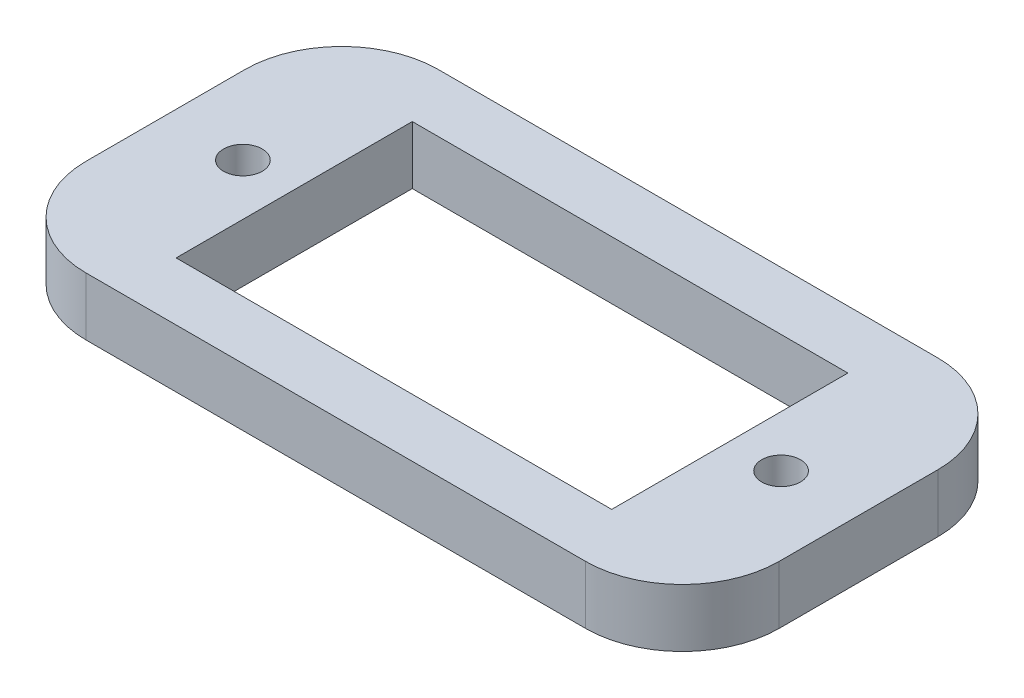
ISO-10303-21;
HEADER;
FILE_DESCRIPTION(('STEP AP214'),'2;1');
FILE_NAME('part.step','',(''),(''),'','','');
FILE_SCHEMA(('AUTOMOTIVE_DESIGN { 1 0 10303 214 1 1 1 1 }'));
ENDSEC;
DATA;
#1=APPLICATION_CONTEXT('core data for automotive mechanical design processes');
#2=APPLICATION_PROTOCOL_DEFINITION('international standard','automotive_design',2000,#1);
#3=PRODUCT_CONTEXT('',#1,'mechanical');
#4=PRODUCT('Part','Part','',(#3));
#5=PRODUCT_RELATED_PRODUCT_CATEGORY('part','',(#4));
#6=PRODUCT_DEFINITION_FORMATION('','',#4);
#7=PRODUCT_DEFINITION_CONTEXT('part definition',#1,'design');
#8=PRODUCT_DEFINITION('design','',#6,#7);
#9=PRODUCT_DEFINITION_SHAPE('','',#8);
#10=(LENGTH_UNIT() NAMED_UNIT(*) SI_UNIT(.MILLI.,.METRE.));
#11=(NAMED_UNIT(*) PLANE_ANGLE_UNIT() SI_UNIT($,.RADIAN.));
#12=(NAMED_UNIT(*) SI_UNIT($,.STERADIAN.) SOLID_ANGLE_UNIT());
#13=UNCERTAINTY_MEASURE_WITH_UNIT(LENGTH_MEASURE(1.E-05),#10,'distance_accuracy_value','');
#14=(GEOMETRIC_REPRESENTATION_CONTEXT(3) GLOBAL_UNCERTAINTY_ASSIGNED_CONTEXT((#13)) GLOBAL_UNIT_ASSIGNED_CONTEXT((#10,
#11,#12)) REPRESENTATION_CONTEXT('',''));
#15=CARTESIAN_POINT('',(0.,0.,0.));
#16=DIRECTION('',(0.,0.,1.));
#17=DIRECTION('',(1.,0.,0.));
#18=AXIS2_PLACEMENT_3D('',#15,#16,#17);
#19=CARTESIAN_POINT('',(0.,1.5,0.));
#20=DIRECTION('',(0.,1.,0.));
#21=DIRECTION('',(0.,0.,1.));
#22=AXIS2_PLACEMENT_3D('',#19,#20,#21);
#23=PLANE('',#22);
#24=CARTESIAN_POINT('',(-13.9,1.5,0.));
#25=DIRECTION('',(0.,1.,0.));
#26=DIRECTION('',(0.,0.,1.));
#27=AXIS2_PLACEMENT_3D('',#24,#25,#26);
#28=CIRCLE('',#27,1.);
#29=CARTESIAN_POINT('',(-13.9,1.5,1.));
#30=VERTEX_POINT('',#29);
#31=EDGE_CURVE('E159',#30,#30,#28,.T.);
#32=ORIENTED_EDGE('',*,*,#31,.F.);
#33=EDGE_LOOP('',(#32));
#34=FACE_BOUND('',#33,.T.);
#35=DIRECTION('',(0.,0.,1.));
#36=VECTOR('',#35,1.);
#37=CARTESIAN_POINT('',(-17.9,1.5,-9.1));
#38=LINE('',#37,#36);
#39=CARTESIAN_POINT('',(-17.9,1.5,-4.1));
#40=VERTEX_POINT('',#39);
#41=CARTESIAN_POINT('',(-17.9,1.5,4.1));
#42=VERTEX_POINT('',#41);
#43=EDGE_CURVE('E170',#40,#42,#38,.T.);
#44=ORIENTED_EDGE('',*,*,#43,.T.);
#45=CARTESIAN_POINT('',(-12.9,1.5,4.1));
#46=DIRECTION('',(0.,1.,0.));
#47=DIRECTION('',(0.,0.,1.));
#48=AXIS2_PLACEMENT_3D('',#45,#46,#47);
#49=CIRCLE('',#48,5.);
#50=CARTESIAN_POINT('',(-12.9,1.5,9.1));
#51=VERTEX_POINT('',#50);
#52=EDGE_CURVE('E213',#42,#51,#49,.T.);
#53=ORIENTED_EDGE('',*,*,#52,.T.);
#54=DIRECTION('',(1.,0.,0.));
#55=VECTOR('',#54,1.);
#56=CARTESIAN_POINT('',(-17.9,1.5,9.1));
#57=LINE('',#56,#55);
#58=CARTESIAN_POINT('',(12.9,1.5,9.1));
#59=VERTEX_POINT('',#58);
#60=EDGE_CURVE('E173',#51,#59,#57,.T.);
#61=ORIENTED_EDGE('',*,*,#60,.T.);
#62=CARTESIAN_POINT('',(12.9,1.5,4.1));
#63=DIRECTION('',(0.,1.,0.));
#64=DIRECTION('',(0.,0.,1.));
#65=AXIS2_PLACEMENT_3D('',#62,#63,#64);
#66=CIRCLE('',#65,5.);
#67=CARTESIAN_POINT('',(17.9,1.5,4.1));
#68=VERTEX_POINT('',#67);
#69=EDGE_CURVE('E211',#59,#68,#66,.T.);
#70=ORIENTED_EDGE('',*,*,#69,.T.);
#71=DIRECTION('',(0.,0.,-1.));
#72=VECTOR('',#71,1.);
#73=CARTESIAN_POINT('',(17.9,1.5,-9.1));
#74=LINE('',#73,#72);
#75=CARTESIAN_POINT('',(17.9,1.5,-4.1));
#76=VERTEX_POINT('',#75);
#77=EDGE_CURVE('E177',#68,#76,#74,.T.);
#78=ORIENTED_EDGE('',*,*,#77,.T.);
#79=CARTESIAN_POINT('',(12.9,1.5,-4.1));
#80=DIRECTION('',(0.,1.,0.));
#81=DIRECTION('',(0.,0.,1.));
#82=AXIS2_PLACEMENT_3D('',#79,#80,#81);
#83=CIRCLE('',#82,5.);
#84=CARTESIAN_POINT('',(12.9,1.5,-9.1));
#85=VERTEX_POINT('',#84);
#86=EDGE_CURVE('E56',#76,#85,#83,.T.);
#87=ORIENTED_EDGE('',*,*,#86,.T.);
#88=DIRECTION('',(-1.,0.,0.));
#89=VECTOR('',#88,1.);
#90=CARTESIAN_POINT('',(-17.9,1.5,-9.1));
#91=LINE('',#90,#89);
#92=CARTESIAN_POINT('',(-12.9,1.5,-9.1));
#93=VERTEX_POINT('',#92);
#94=EDGE_CURVE('E179',#85,#93,#91,.T.);
#95=ORIENTED_EDGE('',*,*,#94,.T.);
#96=CARTESIAN_POINT('',(-12.9,1.5,-4.1));
#97=DIRECTION('',(0.,1.,0.));
#98=DIRECTION('',(0.,0.,1.));
#99=AXIS2_PLACEMENT_3D('',#96,#97,#98);
#100=CIRCLE('',#99,5.);
#101=EDGE_CURVE('E208',#93,#40,#100,.T.);
#102=ORIENTED_EDGE('',*,*,#101,.T.);
#103=EDGE_LOOP('',(#44,#53,#61,#70,#78,#87,#95,#102));
#104=FACE_BOUND('',#103,.T.);
#105=DIRECTION('',(1.,0.,0.));
#106=VECTOR('',#105,1.);
#107=CARTESIAN_POINT('',(-11.25,1.5,6.1));
#108=LINE('',#107,#106);
#109=CARTESIAN_POINT('',(-11.25,1.5,6.1));
#110=VERTEX_POINT('',#109);
#111=CARTESIAN_POINT('',(11.25,1.5,6.1));
#112=VERTEX_POINT('',#111);
#113=EDGE_CURVE('E136',#110,#112,#108,.T.);
#114=ORIENTED_EDGE('',*,*,#113,.F.);
#115=DIRECTION('',(0.,0.,1.));
#116=VECTOR('',#115,1.);
#117=CARTESIAN_POINT('',(-11.25,1.5,-6.1));
#118=LINE('',#117,#116);
#119=CARTESIAN_POINT('',(-11.25,1.5,-6.1));
#120=VERTEX_POINT('',#119);
#121=EDGE_CURVE('E126',#120,#110,#118,.T.);
#122=ORIENTED_EDGE('',*,*,#121,.F.);
#123=DIRECTION('',(-1.,0.,0.));
#124=VECTOR('',#123,1.);
#125=CARTESIAN_POINT('',(-11.25,1.5,-6.1));
#126=LINE('',#125,#124);
#127=CARTESIAN_POINT('',(11.25,1.5,-6.1));
#128=VERTEX_POINT('',#127);
#129=EDGE_CURVE('E152',#128,#120,#126,.T.);
#130=ORIENTED_EDGE('',*,*,#129,.F.);
#131=DIRECTION('',(0.,0.,-1.));
#132=VECTOR('',#131,1.);
#133=CARTESIAN_POINT('',(11.25,1.5,-6.1));
#134=LINE('',#133,#132);
#135=EDGE_CURVE('E150',#112,#128,#134,.T.);
#136=ORIENTED_EDGE('',*,*,#135,.F.);
#137=EDGE_LOOP('',(#114,#122,#130,#136));
#138=FACE_BOUND('',#137,.T.);
#139=CARTESIAN_POINT('',(13.9,1.5,0.));
#140=DIRECTION('',(0.,1.,0.));
#141=DIRECTION('',(0.,0.,-1.));
#142=AXIS2_PLACEMENT_3D('',#139,#140,#141);
#143=CIRCLE('',#142,1.);
#144=CARTESIAN_POINT('',(13.9,1.5,-1.));
#145=VERTEX_POINT('',#144);
#146=EDGE_CURVE('E392',#145,#145,#143,.T.);
#147=ORIENTED_EDGE('',*,*,#146,.F.);
#148=EDGE_LOOP('',(#147));
#149=FACE_BOUND('',#148,.T.);
#150=ADVANCED_FACE('F35',(#34,#104,#138,#149),#23,.T.);
#151=CARTESIAN_POINT('',(0.,-1.5,0.));
#152=DIRECTION('',(0.,1.,0.));
#153=DIRECTION('',(0.,0.,1.));
#154=AXIS2_PLACEMENT_3D('',#151,#152,#153);
#155=PLANE('',#154);
#156=DIRECTION('',(1.,0.,0.));
#157=VECTOR('',#156,1.);
#158=CARTESIAN_POINT('',(-17.9,-1.5,9.1));
#159=LINE('',#158,#157);
#160=CARTESIAN_POINT('',(-12.9,-1.5,9.1));
#161=VERTEX_POINT('',#160);
#162=CARTESIAN_POINT('',(12.9,-1.5,9.1));
#163=VERTEX_POINT('',#162);
#164=EDGE_CURVE('E184',#161,#163,#159,.T.);
#165=ORIENTED_EDGE('',*,*,#164,.F.);
#166=CARTESIAN_POINT('',(-12.9,-1.5,4.1));
#167=DIRECTION('',(0.,1.,0.));
#168=DIRECTION('',(0.,0.,1.));
#169=AXIS2_PLACEMENT_3D('',#166,#167,#168);
#170=CIRCLE('',#169,5.);
#171=CARTESIAN_POINT('',(-17.9,-1.5,4.1));
#172=VERTEX_POINT('',#171);
#173=EDGE_CURVE('E201',#161,#172,#170,.F.);
#174=ORIENTED_EDGE('',*,*,#173,.T.);
#175=DIRECTION('',(0.,0.,1.));
#176=VECTOR('',#175,1.);
#177=CARTESIAN_POINT('',(-17.9,-1.5,-9.1));
#178=LINE('',#177,#176);
#179=CARTESIAN_POINT('',(-17.9,-1.5,-4.1));
#180=VERTEX_POINT('',#179);
#181=EDGE_CURVE('E144',#180,#172,#178,.T.);
#182=ORIENTED_EDGE('',*,*,#181,.F.);
#183=CARTESIAN_POINT('',(-12.9,-1.5,-4.1));
#184=DIRECTION('',(0.,1.,0.));
#185=DIRECTION('',(0.,0.,1.));
#186=AXIS2_PLACEMENT_3D('',#183,#184,#185);
#187=CIRCLE('',#186,5.);
#188=CARTESIAN_POINT('',(-12.9,-1.5,-9.1));
#189=VERTEX_POINT('',#188);
#190=EDGE_CURVE('E195',#180,#189,#187,.F.);
#191=ORIENTED_EDGE('',*,*,#190,.T.);
#192=DIRECTION('',(-1.,0.,0.));
#193=VECTOR('',#192,1.);
#194=CARTESIAN_POINT('',(-17.9,-1.5,-9.1));
#195=LINE('',#194,#193);
#196=CARTESIAN_POINT('',(12.9,-1.5,-9.1));
#197=VERTEX_POINT('',#196);
#198=EDGE_CURVE('E174',#197,#189,#195,.T.);
#199=ORIENTED_EDGE('',*,*,#198,.F.);
#200=CARTESIAN_POINT('',(12.9,-1.5,-4.1));
#201=DIRECTION('',(0.,1.,0.));
#202=DIRECTION('',(0.,0.,1.));
#203=AXIS2_PLACEMENT_3D('',#200,#201,#202);
#204=CIRCLE('',#203,5.);
#205=CARTESIAN_POINT('',(17.9,-1.5,-4.1));
#206=VERTEX_POINT('',#205);
#207=EDGE_CURVE('E197',#197,#206,#204,.F.);
#208=ORIENTED_EDGE('',*,*,#207,.T.);
#209=DIRECTION('',(0.,0.,-1.));
#210=VECTOR('',#209,1.);
#211=CARTESIAN_POINT('',(17.9,-1.5,-9.1));
#212=LINE('',#211,#210);
#213=CARTESIAN_POINT('',(17.9,-1.5,4.1));
#214=VERTEX_POINT('',#213);
#215=EDGE_CURVE('E187',#214,#206,#212,.T.);
#216=ORIENTED_EDGE('',*,*,#215,.F.);
#217=CARTESIAN_POINT('',(12.9,-1.5,4.1));
#218=DIRECTION('',(0.,1.,0.));
#219=DIRECTION('',(0.,0.,1.));
#220=AXIS2_PLACEMENT_3D('',#217,#218,#219);
#221=CIRCLE('',#220,5.);
#222=EDGE_CURVE('E199',#214,#163,#221,.F.);
#223=ORIENTED_EDGE('',*,*,#222,.T.);
#224=EDGE_LOOP('',(#165,#174,#182,#191,#199,#208,#216,#223));
#225=FACE_BOUND('',#224,.T.);
#226=DIRECTION('',(0.,0.,1.));
#227=VECTOR('',#226,1.);
#228=CARTESIAN_POINT('',(-11.25,-1.5,-6.1));
#229=LINE('',#228,#227);
#230=CARTESIAN_POINT('',(-11.25,-1.5,-6.1));
#231=VERTEX_POINT('',#230);
#232=CARTESIAN_POINT('',(-11.25,-1.5,6.1));
#233=VERTEX_POINT('',#232);
#234=EDGE_CURVE('E157',#231,#233,#229,.T.);
#235=ORIENTED_EDGE('',*,*,#234,.T.);
#236=DIRECTION('',(1.,0.,0.));
#237=VECTOR('',#236,1.);
#238=CARTESIAN_POINT('',(-11.25,-1.5,6.1));
#239=LINE('',#238,#237);
#240=CARTESIAN_POINT('',(11.25,-1.5,6.1));
#241=VERTEX_POINT('',#240);
#242=EDGE_CURVE('E143',#233,#241,#239,.T.);
#243=ORIENTED_EDGE('',*,*,#242,.T.);
#244=DIRECTION('',(0.,0.,-1.));
#245=VECTOR('',#244,1.);
#246=CARTESIAN_POINT('',(11.25,-1.5,-6.1));
#247=LINE('',#246,#245);
#248=CARTESIAN_POINT('',(11.25,-1.5,-6.1));
#249=VERTEX_POINT('',#248);
#250=EDGE_CURVE('E161',#241,#249,#247,.T.);
#251=ORIENTED_EDGE('',*,*,#250,.T.);
#252=DIRECTION('',(-1.,0.,0.));
#253=VECTOR('',#252,1.);
#254=CARTESIAN_POINT('',(-11.25,-1.5,-6.1));
#255=LINE('',#254,#253);
#256=EDGE_CURVE('E137',#249,#231,#255,.T.);
#257=ORIENTED_EDGE('',*,*,#256,.T.);
#258=EDGE_LOOP('',(#235,#243,#251,#257));
#259=FACE_BOUND('',#258,.T.);
#260=CARTESIAN_POINT('',(-13.9,-1.5,0.));
#261=DIRECTION('',(0.,1.,0.));
#262=DIRECTION('',(0.,0.,1.));
#263=AXIS2_PLACEMENT_3D('',#260,#261,#262);
#264=CIRCLE('',#263,1.);
#265=CARTESIAN_POINT('',(-13.9,-1.5,1.));
#266=VERTEX_POINT('',#265);
#267=EDGE_CURVE('E398',#266,#266,#264,.T.);
#268=ORIENTED_EDGE('',*,*,#267,.T.);
#269=EDGE_LOOP('',(#268));
#270=FACE_BOUND('',#269,.T.);
#271=CARTESIAN_POINT('',(13.9,-1.5,0.));
#272=DIRECTION('',(0.,1.,0.));
#273=DIRECTION('',(0.,0.,-1.));
#274=AXIS2_PLACEMENT_3D('',#271,#272,#273);
#275=CIRCLE('',#274,1.);
#276=CARTESIAN_POINT('',(13.9,-1.5,-1.));
#277=VERTEX_POINT('',#276);
#278=EDGE_CURVE('E395',#277,#277,#275,.T.);
#279=ORIENTED_EDGE('',*,*,#278,.T.);
#280=EDGE_LOOP('',(#279));
#281=FACE_BOUND('',#280,.T.);
#282=ADVANCED_FACE('F229',(#225,#259,#270,#281),#155,.F.);
#283=CARTESIAN_POINT('',(-17.9,1.5,-9.1));
#284=DIRECTION('',(1.,0.,0.));
#285=DIRECTION('',(0.,0.,-1.));
#286=AXIS2_PLACEMENT_3D('',#283,#284,#285);
#287=PLANE('',#286);
#288=ORIENTED_EDGE('',*,*,#181,.T.);
#289=DIRECTION('',(0.,-1.,0.));
#290=VECTOR('',#289,1.);
#291=CARTESIAN_POINT('',(-17.9,1.5,4.1));
#292=LINE('',#291,#290);
#293=EDGE_CURVE('E206',#172,#42,#292,.F.);
#294=ORIENTED_EDGE('',*,*,#293,.T.);
#295=ORIENTED_EDGE('',*,*,#43,.F.);
#296=DIRECTION('',(0.,-1.,0.));
#297=VECTOR('',#296,1.);
#298=CARTESIAN_POINT('',(-17.9,1.5,-4.1));
#299=LINE('',#298,#297);
#300=EDGE_CURVE('E203',#40,#180,#299,.T.);
#301=ORIENTED_EDGE('',*,*,#300,.T.);
#302=EDGE_LOOP('',(#288,#294,#295,#301));
#303=FACE_BOUND('',#302,.T.);
#304=ADVANCED_FACE('F242',(#303),#287,.F.);
#305=CARTESIAN_POINT('',(-17.9,1.5,9.1));
#306=DIRECTION('',(0.,0.,-1.));
#307=DIRECTION('',(-1.,0.,0.));
#308=AXIS2_PLACEMENT_3D('',#305,#306,#307);
#309=PLANE('',#308);
#310=ORIENTED_EDGE('',*,*,#60,.F.);
#311=DIRECTION('',(0.,-1.,0.));
#312=VECTOR('',#311,1.);
#313=CARTESIAN_POINT('',(-12.9,1.5,9.1));
#314=LINE('',#313,#312);
#315=EDGE_CURVE('E192',#51,#161,#314,.T.);
#316=ORIENTED_EDGE('',*,*,#315,.T.);
#317=ORIENTED_EDGE('',*,*,#164,.T.);
#318=DIRECTION('',(0.,-1.,0.));
#319=VECTOR('',#318,1.);
#320=CARTESIAN_POINT('',(12.9,1.5,9.1));
#321=LINE('',#320,#319);
#322=EDGE_CURVE('E181',#163,#59,#321,.F.);
#323=ORIENTED_EDGE('',*,*,#322,.T.);
#324=EDGE_LOOP('',(#310,#316,#317,#323));
#325=FACE_BOUND('',#324,.T.);
#326=ADVANCED_FACE('F250',(#325),#309,.F.);
#327=CARTESIAN_POINT('',(17.9,1.5,-9.1));
#328=DIRECTION('',(-1.,0.,0.));
#329=DIRECTION('',(0.,0.,1.));
#330=AXIS2_PLACEMENT_3D('',#327,#328,#329);
#331=PLANE('',#330);
#332=ORIENTED_EDGE('',*,*,#77,.F.);
#333=DIRECTION('',(0.,-1.,0.));
#334=VECTOR('',#333,1.);
#335=CARTESIAN_POINT('',(17.9,1.5,4.1));
#336=LINE('',#335,#334);
#337=EDGE_CURVE('E217',#68,#214,#336,.T.);
#338=ORIENTED_EDGE('',*,*,#337,.T.);
#339=ORIENTED_EDGE('',*,*,#215,.T.);
#340=DIRECTION('',(0.,-1.,0.));
#341=VECTOR('',#340,1.);
#342=CARTESIAN_POINT('',(17.9,1.5,-4.1));
#343=LINE('',#342,#341);
#344=EDGE_CURVE('E215',#206,#76,#343,.F.);
#345=ORIENTED_EDGE('',*,*,#344,.T.);
#346=EDGE_LOOP('',(#332,#338,#339,#345));
#347=FACE_BOUND('',#346,.T.);
#348=ADVANCED_FACE('F223',(#347),#331,.F.);
#349=CARTESIAN_POINT('',(-17.9,1.5,-9.1));
#350=DIRECTION('',(0.,0.,1.));
#351=DIRECTION('',(1.,0.,0.));
#352=AXIS2_PLACEMENT_3D('',#349,#350,#351);
#353=PLANE('',#352);
#354=ORIENTED_EDGE('',*,*,#94,.F.);
#355=DIRECTION('',(0.,-1.,0.));
#356=VECTOR('',#355,1.);
#357=CARTESIAN_POINT('',(12.9,1.5,-9.1));
#358=LINE('',#357,#356);
#359=EDGE_CURVE('E11',#85,#197,#358,.T.);
#360=ORIENTED_EDGE('',*,*,#359,.T.);
#361=ORIENTED_EDGE('',*,*,#198,.T.);
#362=DIRECTION('',(0.,-1.,0.));
#363=VECTOR('',#362,1.);
#364=CARTESIAN_POINT('',(-12.9,1.5,-9.1));
#365=LINE('',#364,#363);
#366=EDGE_CURVE('E43',#189,#93,#365,.F.);
#367=ORIENTED_EDGE('',*,*,#366,.T.);
#368=EDGE_LOOP('',(#354,#360,#361,#367));
#369=FACE_BOUND('',#368,.T.);
#370=ADVANCED_FACE('F235',(#369),#353,.F.);
#371=CARTESIAN_POINT('',(-11.25,1.5,-6.1));
#372=DIRECTION('',(1.,0.,0.));
#373=DIRECTION('',(0.,0.,-1.));
#374=AXIS2_PLACEMENT_3D('',#371,#372,#373);
#375=PLANE('',#374);
#376=ORIENTED_EDGE('',*,*,#234,.F.);
#377=DIRECTION('',(0.,-1.,0.));
#378=VECTOR('',#377,1.);
#379=CARTESIAN_POINT('',(-11.25,1.5,-6.1));
#380=LINE('',#379,#378);
#381=EDGE_CURVE('E132',#120,#231,#380,.T.);
#382=ORIENTED_EDGE('',*,*,#381,.F.);
#383=ORIENTED_EDGE('',*,*,#121,.T.);
#384=DIRECTION('',(0.,-1.,0.));
#385=VECTOR('',#384,1.);
#386=CARTESIAN_POINT('',(-11.25,1.5,6.1));
#387=LINE('',#386,#385);
#388=EDGE_CURVE('E129',#110,#233,#387,.T.);
#389=ORIENTED_EDGE('',*,*,#388,.T.);
#390=EDGE_LOOP('',(#376,#382,#383,#389));
#391=FACE_BOUND('',#390,.T.);
#392=ADVANCED_FACE('F128',(#391),#375,.T.);
#393=CARTESIAN_POINT('',(-11.25,1.5,6.1));
#394=DIRECTION('',(0.,0.,-1.));
#395=DIRECTION('',(-1.,0.,0.));
#396=AXIS2_PLACEMENT_3D('',#393,#394,#395);
#397=PLANE('',#396);
#398=ORIENTED_EDGE('',*,*,#242,.F.);
#399=ORIENTED_EDGE('',*,*,#388,.F.);
#400=ORIENTED_EDGE('',*,*,#113,.T.);
#401=DIRECTION('',(0.,-1.,0.));
#402=VECTOR('',#401,1.);
#403=CARTESIAN_POINT('',(11.25,1.5,6.1));
#404=LINE('',#403,#402);
#405=EDGE_CURVE('E145',#112,#241,#404,.T.);
#406=ORIENTED_EDGE('',*,*,#405,.T.);
#407=EDGE_LOOP('',(#398,#399,#400,#406));
#408=FACE_BOUND('',#407,.T.);
#409=ADVANCED_FACE('F140',(#408),#397,.T.);
#410=CARTESIAN_POINT('',(11.25,1.5,-6.1));
#411=DIRECTION('',(-1.,0.,0.));
#412=DIRECTION('',(0.,0.,1.));
#413=AXIS2_PLACEMENT_3D('',#410,#411,#412);
#414=PLANE('',#413);
#415=ORIENTED_EDGE('',*,*,#250,.F.);
#416=ORIENTED_EDGE('',*,*,#405,.F.);
#417=ORIENTED_EDGE('',*,*,#135,.T.);
#418=DIRECTION('',(0.,-1.,0.));
#419=VECTOR('',#418,1.);
#420=CARTESIAN_POINT('',(11.25,1.5,-6.1));
#421=LINE('',#420,#419);
#422=EDGE_CURVE('E167',#128,#249,#421,.T.);
#423=ORIENTED_EDGE('',*,*,#422,.T.);
#424=EDGE_LOOP('',(#415,#416,#417,#423));
#425=FACE_BOUND('',#424,.T.);
#426=ADVANCED_FACE('F307',(#425),#414,.T.);
#427=CARTESIAN_POINT('',(-11.25,1.5,-6.1));
#428=DIRECTION('',(0.,0.,1.));
#429=DIRECTION('',(1.,0.,0.));
#430=AXIS2_PLACEMENT_3D('',#427,#428,#429);
#431=PLANE('',#430);
#432=ORIENTED_EDGE('',*,*,#256,.F.);
#433=ORIENTED_EDGE('',*,*,#422,.F.);
#434=ORIENTED_EDGE('',*,*,#129,.T.);
#435=ORIENTED_EDGE('',*,*,#381,.T.);
#436=EDGE_LOOP('',(#432,#433,#434,#435));
#437=FACE_BOUND('',#436,.T.);
#438=ADVANCED_FACE('F313',(#437),#431,.T.);
#439=CARTESIAN_POINT('',(-13.9,1.5,0.));
#440=DIRECTION('',(0.,-1.,0.));
#441=DIRECTION('',(0.,0.,-1.));
#442=AXIS2_PLACEMENT_3D('',#439,#440,#441);
#443=CYLINDRICAL_SURFACE('',#442,1.);
#444=ORIENTED_EDGE('',*,*,#31,.T.);
#445=EDGE_LOOP('',(#444));
#446=FACE_BOUND('',#445,.T.);
#447=ORIENTED_EDGE('',*,*,#267,.F.);
#448=EDGE_LOOP('',(#447));
#449=FACE_BOUND('',#448,.T.);
#450=ADVANCED_FACE('F321',(#446,#449),#443,.F.);
#451=CARTESIAN_POINT('',(13.9,1.5,0.));
#452=DIRECTION('',(0.,-1.,0.));
#453=DIRECTION('',(0.,0.,-1.));
#454=AXIS2_PLACEMENT_3D('',#451,#452,#453);
#455=CYLINDRICAL_SURFACE('',#454,1.);
#456=ORIENTED_EDGE('',*,*,#146,.T.);
#457=EDGE_LOOP('',(#456));
#458=FACE_BOUND('',#457,.T.);
#459=ORIENTED_EDGE('',*,*,#278,.F.);
#460=EDGE_LOOP('',(#459));
#461=FACE_BOUND('',#460,.T.);
#462=ADVANCED_FACE('F259',(#458,#461),#455,.F.);
#463=CARTESIAN_POINT('',(-12.9,1.5,4.1));
#464=DIRECTION('',(0.,-1.,0.));
#465=DIRECTION('',(0.,0.,-1.));
#466=AXIS2_PLACEMENT_3D('',#463,#464,#465);
#467=CYLINDRICAL_SURFACE('',#466,5.);
#468=ORIENTED_EDGE('',*,*,#52,.F.);
#469=ORIENTED_EDGE('',*,*,#293,.F.);
#470=ORIENTED_EDGE('',*,*,#173,.F.);
#471=ORIENTED_EDGE('',*,*,#315,.F.);
#472=EDGE_LOOP('',(#468,#469,#470,#471));
#473=FACE_BOUND('',#472,.T.);
#474=ADVANCED_FACE('F247',(#473),#467,.T.);
#475=CARTESIAN_POINT('',(12.9,1.5,4.1));
#476=DIRECTION('',(0.,-1.,0.));
#477=DIRECTION('',(0.,0.,-1.));
#478=AXIS2_PLACEMENT_3D('',#475,#476,#477);
#479=CYLINDRICAL_SURFACE('',#478,5.);
#480=ORIENTED_EDGE('',*,*,#69,.F.);
#481=ORIENTED_EDGE('',*,*,#322,.F.);
#482=ORIENTED_EDGE('',*,*,#222,.F.);
#483=ORIENTED_EDGE('',*,*,#337,.F.);
#484=EDGE_LOOP('',(#480,#481,#482,#483));
#485=FACE_BOUND('',#484,.T.);
#486=ADVANCED_FACE('F252',(#485),#479,.T.);
#487=CARTESIAN_POINT('',(12.9,1.5,-4.1));
#488=DIRECTION('',(0.,-1.,0.));
#489=DIRECTION('',(0.,0.,-1.));
#490=AXIS2_PLACEMENT_3D('',#487,#488,#489);
#491=CYLINDRICAL_SURFACE('',#490,5.);
#492=ORIENTED_EDGE('',*,*,#86,.F.);
#493=ORIENTED_EDGE('',*,*,#344,.F.);
#494=ORIENTED_EDGE('',*,*,#207,.F.);
#495=ORIENTED_EDGE('',*,*,#359,.F.);
#496=EDGE_LOOP('',(#492,#493,#494,#495));
#497=FACE_BOUND('',#496,.T.);
#498=ADVANCED_FACE('F234',(#497),#491,.T.);
#499=CARTESIAN_POINT('',(-12.9,1.5,-4.1));
#500=DIRECTION('',(0.,-1.,0.));
#501=DIRECTION('',(0.,0.,-1.));
#502=AXIS2_PLACEMENT_3D('',#499,#500,#501);
#503=CYLINDRICAL_SURFACE('',#502,5.);
#504=ORIENTED_EDGE('',*,*,#101,.F.);
#505=ORIENTED_EDGE('',*,*,#366,.F.);
#506=ORIENTED_EDGE('',*,*,#190,.F.);
#507=ORIENTED_EDGE('',*,*,#300,.F.);
#508=EDGE_LOOP('',(#504,#505,#506,#507));
#509=FACE_BOUND('',#508,.T.);
#510=ADVANCED_FACE('F37',(#509),#503,.T.);
#511=CLOSED_SHELL('',(#150,#282,#304,#326,#348,#370,#392,#409,#426,#438,#450,#462,#474,#486,
#498,#510));
#512=MANIFOLD_SOLID_BREP('B2',#511);
#513=ADVANCED_BREP_SHAPE_REPRESENTATION('',(#18,#512),#14);
#514=SHAPE_DEFINITION_REPRESENTATION(#9,#513);
ENDSEC;
END-ISO-10303-21;
